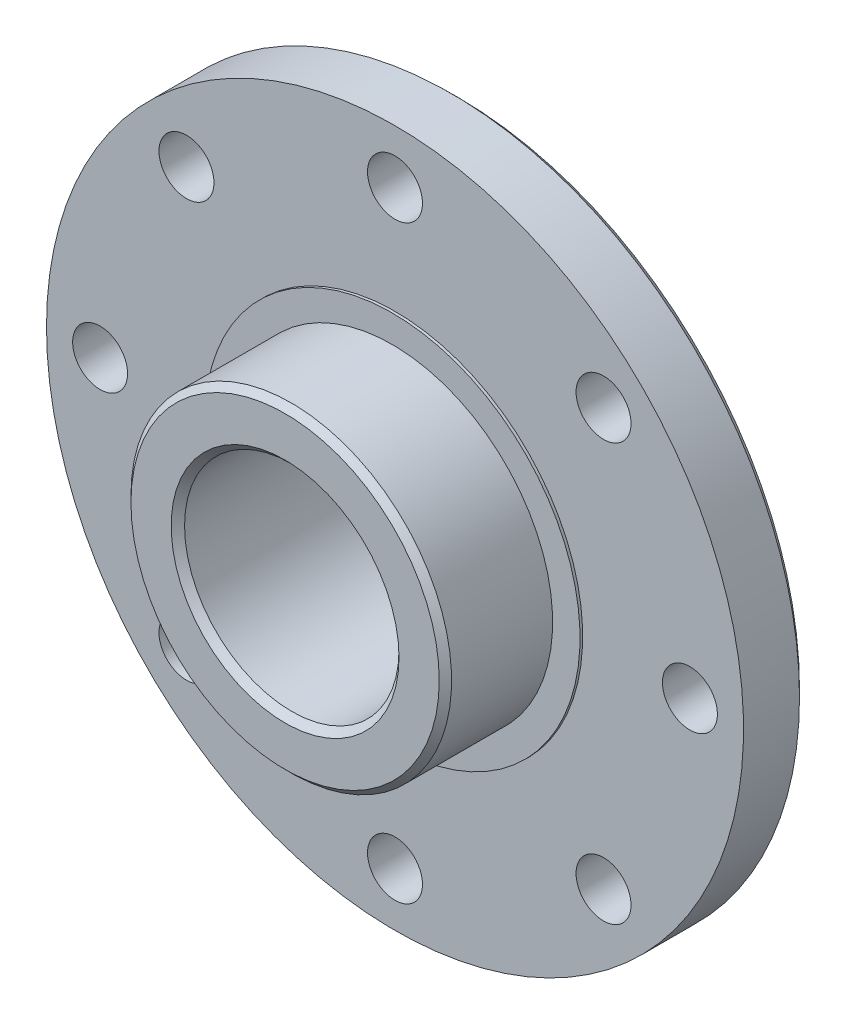
ISO-10303-21;
HEADER;
FILE_DESCRIPTION(('STEP AP214'),'2;1');
FILE_NAME('part.step','',(''),(''),'','','');
FILE_SCHEMA(('AUTOMOTIVE_DESIGN { 1 0 10303 214 1 1 1 1 }'));
ENDSEC;
DATA;
#1=APPLICATION_CONTEXT('core data for automotive mechanical design processes');
#2=APPLICATION_PROTOCOL_DEFINITION('international standard','automotive_design',2000,#1);
#3=PRODUCT_CONTEXT('',#1,'mechanical');
#4=PRODUCT('Part','Part','',(#3));
#5=PRODUCT_RELATED_PRODUCT_CATEGORY('part','',(#4));
#6=PRODUCT_DEFINITION_FORMATION('','',#4);
#7=PRODUCT_DEFINITION_CONTEXT('part definition',#1,'design');
#8=PRODUCT_DEFINITION('design','',#6,#7);
#9=PRODUCT_DEFINITION_SHAPE('','',#8);
#10=(LENGTH_UNIT() NAMED_UNIT(*) SI_UNIT(.MILLI.,.METRE.));
#11=(NAMED_UNIT(*) PLANE_ANGLE_UNIT() SI_UNIT($,.RADIAN.));
#12=(NAMED_UNIT(*) SI_UNIT($,.STERADIAN.) SOLID_ANGLE_UNIT());
#13=UNCERTAINTY_MEASURE_WITH_UNIT(LENGTH_MEASURE(1.E-05),#10,'distance_accuracy_value','');
#14=(GEOMETRIC_REPRESENTATION_CONTEXT(3) GLOBAL_UNCERTAINTY_ASSIGNED_CONTEXT((#13)) GLOBAL_UNIT_ASSIGNED_CONTEXT((#10,
#11,#12)) REPRESENTATION_CONTEXT('',''));
#15=CARTESIAN_POINT('',(0.,0.,0.));
#16=DIRECTION('',(0.,0.,1.));
#17=DIRECTION('',(1.,0.,0.));
#18=AXIS2_PLACEMENT_3D('',#15,#16,#17);
#19=CARTESIAN_POINT('',(-4.00000000000044,12.3693168768528,-22.));
#20=DIRECTION('',(0.,0.,-1.));
#21=DIRECTION('',(-1.,0.,0.));
#22=AXIS2_PLACEMENT_3D('',#19,#20,#21);
#23=PLANE('',#22);
#24=CARTESIAN_POINT('',(0.,0.,-22.));
#25=DIRECTION('',(0.,0.,-1.));
#26=DIRECTION('',(-1.,0.,0.));
#27=AXIS2_PLACEMENT_3D('',#24,#25,#26);
#28=CIRCLE('',#27,13.);
#29=CARTESIAN_POINT('',(-13.,0.,-22.));
#30=VERTEX_POINT('',#29);
#31=EDGE_CURVE('E58',#30,#30,#28,.T.);
#32=ORIENTED_EDGE('',*,*,#31,.F.);
#33=EDGE_LOOP('',(#32));
#34=FACE_BOUND('',#33,.T.);
#35=CARTESIAN_POINT('',(-7.778174593052,7.778174593052,-22.));
#36=DIRECTION('',(0.,0.,-1.));
#37=DIRECTION('',(-1.,0.,0.));
#38=AXIS2_PLACEMENT_3D('',#35,#36,#37);
#39=CIRCLE('',#38,1.025);
#40=CARTESIAN_POINT('',(-8.803174593052,7.778174593052,-22.));
#41=VERTEX_POINT('',#40);
#42=EDGE_CURVE('E98',#41,#41,#39,.T.);
#43=ORIENTED_EDGE('',*,*,#42,.T.);
#44=EDGE_LOOP('',(#43));
#45=FACE_BOUND('',#44,.T.);
#46=CARTESIAN_POINT('',(-11.,0.,-22.));
#47=DIRECTION('',(0.,0.,-1.));
#48=DIRECTION('',(-1.,0.,0.));
#49=AXIS2_PLACEMENT_3D('',#46,#47,#48);
#50=CIRCLE('',#49,1.025);
#51=CARTESIAN_POINT('',(-12.025,0.,-22.));
#52=VERTEX_POINT('',#51);
#53=EDGE_CURVE('E145',#52,#52,#50,.T.);
#54=ORIENTED_EDGE('',*,*,#53,.T.);
#55=EDGE_LOOP('',(#54));
#56=FACE_BOUND('',#55,.T.);
#57=CARTESIAN_POINT('',(-7.778174593052,-7.778174593052,-22.));
#58=DIRECTION('',(0.,0.,-1.));
#59=DIRECTION('',(-1.,0.,0.));
#60=AXIS2_PLACEMENT_3D('',#57,#58,#59);
#61=CIRCLE('',#60,1.025);
#62=CARTESIAN_POINT('',(-8.803174593052,-7.778174593052,-22.));
#63=VERTEX_POINT('',#62);
#64=EDGE_CURVE('E142',#63,#63,#61,.T.);
#65=ORIENTED_EDGE('',*,*,#64,.T.);
#66=EDGE_LOOP('',(#65));
#67=FACE_BOUND('',#66,.T.);
#68=CARTESIAN_POINT('',(0.,-11.,-22.));
#69=DIRECTION('',(0.,0.,-1.));
#70=DIRECTION('',(-1.,0.,0.));
#71=AXIS2_PLACEMENT_3D('',#68,#69,#70);
#72=CIRCLE('',#71,1.025);
#73=CARTESIAN_POINT('',(-1.025,-11.,-22.));
#74=VERTEX_POINT('',#73);
#75=EDGE_CURVE('E139',#74,#74,#72,.T.);
#76=ORIENTED_EDGE('',*,*,#75,.T.);
#77=EDGE_LOOP('',(#76));
#78=FACE_BOUND('',#77,.T.);
#79=CARTESIAN_POINT('',(7.778174593052,-7.778174593052,-22.));
#80=DIRECTION('',(0.,0.,-1.));
#81=DIRECTION('',(-1.,0.,0.));
#82=AXIS2_PLACEMENT_3D('',#79,#80,#81);
#83=CIRCLE('',#82,1.025);
#84=CARTESIAN_POINT('',(6.753174593052,-7.778174593052,-22.));
#85=VERTEX_POINT('',#84);
#86=EDGE_CURVE('E136',#85,#85,#83,.T.);
#87=ORIENTED_EDGE('',*,*,#86,.T.);
#88=EDGE_LOOP('',(#87));
#89=FACE_BOUND('',#88,.T.);
#90=CARTESIAN_POINT('',(11.,0.,-22.));
#91=DIRECTION('',(0.,0.,-1.));
#92=DIRECTION('',(-1.,0.,0.));
#93=AXIS2_PLACEMENT_3D('',#90,#91,#92);
#94=CIRCLE('',#93,1.025);
#95=CARTESIAN_POINT('',(9.975,0.,-22.));
#96=VERTEX_POINT('',#95);
#97=EDGE_CURVE('E133',#96,#96,#94,.T.);
#98=ORIENTED_EDGE('',*,*,#97,.T.);
#99=EDGE_LOOP('',(#98));
#100=FACE_BOUND('',#99,.T.);
#101=CARTESIAN_POINT('',(7.778174593052,7.778174593052,-22.));
#102=DIRECTION('',(0.,0.,-1.));
#103=DIRECTION('',(-1.,0.,0.));
#104=AXIS2_PLACEMENT_3D('',#101,#102,#103);
#105=CIRCLE('',#104,1.025);
#106=CARTESIAN_POINT('',(6.753174593052,7.778174593052,-22.));
#107=VERTEX_POINT('',#106);
#108=EDGE_CURVE('E129',#107,#107,#105,.T.);
#109=ORIENTED_EDGE('',*,*,#108,.T.);
#110=EDGE_LOOP('',(#109));
#111=FACE_BOUND('',#110,.T.);
#112=CARTESIAN_POINT('',(0.,11.,-22.));
#113=DIRECTION('',(0.,0.,-1.));
#114=DIRECTION('',(-1.,0.,0.));
#115=AXIS2_PLACEMENT_3D('',#112,#113,#114);
#116=CIRCLE('',#115,1.025);
#117=CARTESIAN_POINT('',(-1.025,11.,-22.));
#118=VERTEX_POINT('',#117);
#119=EDGE_CURVE('E126',#118,#118,#116,.T.);
#120=ORIENTED_EDGE('',*,*,#119,.T.);
#121=EDGE_LOOP('',(#120));
#122=FACE_BOUND('',#121,.T.);
#123=CARTESIAN_POINT('',(0.,0.,-22.));
#124=DIRECTION('',(0.,0.,-1.));
#125=DIRECTION('',(-1.,0.,0.));
#126=AXIS2_PLACEMENT_3D('',#123,#124,#125);
#127=CIRCLE('',#126,7.);
#128=CARTESIAN_POINT('',(-7.,0.,-22.));
#129=VERTEX_POINT('',#128);
#130=EDGE_CURVE('E94',#129,#129,#127,.F.);
#131=ORIENTED_EDGE('',*,*,#130,.F.);
#132=EDGE_LOOP('',(#131));
#133=FACE_BOUND('',#132,.T.);
#134=ADVANCED_FACE('F37',(#34,#45,#56,#67,#78,#89,#100,#111,#122,#133),#23,.F.);
#135=CARTESIAN_POINT('',(0.,0.,-24.35));
#136=DIRECTION('',(0.,0.,-1.));
#137=DIRECTION('',(-1.,0.,0.));
#138=AXIS2_PLACEMENT_3D('',#135,#136,#137);
#139=PLANE('',#138);
#140=CARTESIAN_POINT('',(0.,0.,-24.35));
#141=DIRECTION('',(0.,0.,-1.));
#142=DIRECTION('',(-1.,0.,0.));
#143=AXIS2_PLACEMENT_3D('',#140,#141,#142);
#144=CIRCLE('',#143,4.31213203435596);
#145=CARTESIAN_POINT('',(-4.31213203435596,0.,-24.35));
#146=VERTEX_POINT('',#145);
#147=EDGE_CURVE('E12',#146,#146,#144,.F.);
#148=ORIENTED_EDGE('',*,*,#147,.T.);
#149=EDGE_LOOP('',(#148));
#150=FACE_BOUND('',#149,.T.);
#151=CARTESIAN_POINT('',(-7.778174593052,7.778174593052,-24.35));
#152=DIRECTION('',(0.,0.,-1.));
#153=DIRECTION('',(-1.,0.,0.));
#154=AXIS2_PLACEMENT_3D('',#151,#152,#153);
#155=CIRCLE('',#154,1.19999999995154);
#156=CARTESIAN_POINT('',(-8.97817459300354,7.778174593052,-24.35));
#157=VERTEX_POINT('',#156);
#158=EDGE_CURVE('E59',#157,#157,#155,.F.);
#159=ORIENTED_EDGE('',*,*,#158,.T.);
#160=EDGE_LOOP('',(#159));
#161=FACE_BOUND('',#160,.T.);
#162=CARTESIAN_POINT('',(-11.,0.,-24.35));
#163=DIRECTION('',(0.,0.,-1.));
#164=DIRECTION('',(-1.,0.,0.));
#165=AXIS2_PLACEMENT_3D('',#162,#163,#164);
#166=CIRCLE('',#165,1.2000000000131);
#167=CARTESIAN_POINT('',(-12.2000000000131,0.,-24.35));
#168=VERTEX_POINT('',#167);
#169=EDGE_CURVE('E62',#168,#168,#166,.F.);
#170=ORIENTED_EDGE('',*,*,#169,.T.);
#171=EDGE_LOOP('',(#170));
#172=FACE_BOUND('',#171,.T.);
#173=CARTESIAN_POINT('',(-7.778174593052,-7.778174593052,-24.35));
#174=DIRECTION('',(0.,0.,-1.));
#175=DIRECTION('',(-1.,0.,0.));
#176=AXIS2_PLACEMENT_3D('',#173,#174,#175);
#177=CIRCLE('',#176,1.19999999995154);
#178=CARTESIAN_POINT('',(-8.97817459300354,-7.778174593052,-24.35));
#179=VERTEX_POINT('',#178);
#180=EDGE_CURVE('E65',#179,#179,#177,.F.);
#181=ORIENTED_EDGE('',*,*,#180,.T.);
#182=EDGE_LOOP('',(#181));
#183=FACE_BOUND('',#182,.T.);
#184=CARTESIAN_POINT('',(0.,-11.,-24.35));
#185=DIRECTION('',(0.,0.,-1.));
#186=DIRECTION('',(-1.,0.,0.));
#187=AXIS2_PLACEMENT_3D('',#184,#185,#186);
#188=CIRCLE('',#187,1.2000000000131);
#189=CARTESIAN_POINT('',(-1.2000000000131,-11.,-24.35));
#190=VERTEX_POINT('',#189);
#191=EDGE_CURVE('E68',#190,#190,#188,.F.);
#192=ORIENTED_EDGE('',*,*,#191,.T.);
#193=EDGE_LOOP('',(#192));
#194=FACE_BOUND('',#193,.T.);
#195=CARTESIAN_POINT('',(7.778174593052,-7.778174593052,-24.35));
#196=DIRECTION('',(0.,0.,-1.));
#197=DIRECTION('',(-1.,0.,0.));
#198=AXIS2_PLACEMENT_3D('',#195,#196,#197);
#199=CIRCLE('',#198,1.19999999995154);
#200=CARTESIAN_POINT('',(6.57817459310046,-7.778174593052,-24.35));
#201=VERTEX_POINT('',#200);
#202=EDGE_CURVE('E71',#201,#201,#199,.F.);
#203=ORIENTED_EDGE('',*,*,#202,.T.);
#204=EDGE_LOOP('',(#203));
#205=FACE_BOUND('',#204,.T.);
#206=CARTESIAN_POINT('',(11.,0.,-24.35));
#207=DIRECTION('',(0.,0.,-1.));
#208=DIRECTION('',(-1.,0.,0.));
#209=AXIS2_PLACEMENT_3D('',#206,#207,#208);
#210=CIRCLE('',#209,1.2000000000131);
#211=CARTESIAN_POINT('',(9.7999999999869,0.,-24.35));
#212=VERTEX_POINT('',#211);
#213=EDGE_CURVE('E74',#212,#212,#210,.F.);
#214=ORIENTED_EDGE('',*,*,#213,.T.);
#215=EDGE_LOOP('',(#214));
#216=FACE_BOUND('',#215,.T.);
#217=CARTESIAN_POINT('',(7.778174593052,7.778174593052,-24.35));
#218=DIRECTION('',(0.,0.,-1.));
#219=DIRECTION('',(-1.,0.,0.));
#220=AXIS2_PLACEMENT_3D('',#217,#218,#219);
#221=CIRCLE('',#220,1.19999999995154);
#222=CARTESIAN_POINT('',(6.57817459310046,7.778174593052,-24.35));
#223=VERTEX_POINT('',#222);
#224=EDGE_CURVE('E77',#223,#223,#221,.F.);
#225=ORIENTED_EDGE('',*,*,#224,.T.);
#226=EDGE_LOOP('',(#225));
#227=FACE_BOUND('',#226,.T.);
#228=CARTESIAN_POINT('',(0.,11.,-24.35));
#229=DIRECTION('',(0.,0.,-1.));
#230=DIRECTION('',(-1.,0.,0.));
#231=AXIS2_PLACEMENT_3D('',#228,#229,#230);
#232=CIRCLE('',#231,1.2000000000131);
#233=CARTESIAN_POINT('',(-1.2000000000131,11.,-24.35));
#234=VERTEX_POINT('',#233);
#235=EDGE_CURVE('E79',#234,#234,#232,.F.);
#236=ORIENTED_EDGE('',*,*,#235,.T.);
#237=EDGE_LOOP('',(#236));
#238=FACE_BOUND('',#237,.T.);
#239=CARTESIAN_POINT('',(0.,-1.14491749414469E-13,-24.35));
#240=DIRECTION('',(0.,0.,-1.));
#241=DIRECTION('',(-1.,0.,0.));
#242=AXIS2_PLACEMENT_3D('',#239,#240,#241);
#243=CIRCLE('',#242,12.7378679656441);
#244=CARTESIAN_POINT('',(-12.7378679656441,-1.14491749414469E-13,-24.35));
#245=VERTEX_POINT('',#244);
#246=EDGE_CURVE('E53',#245,#245,#243,.F.);
#247=ORIENTED_EDGE('',*,*,#246,.F.);
#248=EDGE_LOOP('',(#247));
#249=FACE_BOUND('',#248,.T.);
#250=ADVANCED_FACE('F39',(#150,#161,#172,#183,#194,#205,#216,#227,#238,#249),#139,.T.);
#251=CARTESIAN_POINT('',(0.,-1.14491749414469E-13,-24.193933982822));
#252=DIRECTION('',(0.,0.,1.));
#253=DIRECTION('',(1.,0.,0.));
#254=AXIS2_PLACEMENT_3D('',#251,#252,#253);
#255=CONICAL_SURFACE('',#254,12.893933982822,0.785398163397297);
#256=ORIENTED_EDGE('',*,*,#246,.T.);
#257=EDGE_LOOP('',(#256));
#258=FACE_BOUND('',#257,.T.);
#259=CARTESIAN_POINT('',(0.,-1.14491749414469E-13,-24.087867965644));
#260=DIRECTION('',(0.,0.,1.));
#261=DIRECTION('',(1.,0.,0.));
#262=AXIS2_PLACEMENT_3D('',#259,#260,#261);
#263=CIRCLE('',#262,13.);
#264=CARTESIAN_POINT('',(13.,-1.14491749414469E-13,-24.087867965644));
#265=VERTEX_POINT('',#264);
#266=EDGE_CURVE('E55',#265,#265,#263,.T.);
#267=ORIENTED_EDGE('',*,*,#266,.F.);
#268=EDGE_LOOP('',(#267));
#269=FACE_BOUND('',#268,.T.);
#270=ADVANCED_FACE('F178',(#258,#269),#255,.T.);
#271=CARTESIAN_POINT('',(0.,0.,-21.875));
#272=DIRECTION('',(0.,0.,-1.));
#273=DIRECTION('',(-1.,0.,0.));
#274=AXIS2_PLACEMENT_3D('',#271,#272,#273);
#275=CYLINDRICAL_SURFACE('',#274,13.);
#276=ORIENTED_EDGE('',*,*,#31,.T.);
#277=EDGE_LOOP('',(#276));
#278=FACE_BOUND('',#277,.T.);
#279=ORIENTED_EDGE('',*,*,#266,.T.);
#280=EDGE_LOOP('',(#279));
#281=FACE_BOUND('',#280,.T.);
#282=ADVANCED_FACE('F193',(#278,#281),#275,.T.);
#283=CARTESIAN_POINT('',(-7.778174593052,7.778174593052,-24.4999999999891));
#284=DIRECTION('',(0.,0.,-1.));
#285=DIRECTION('',(-1.,0.,0.));
#286=AXIS2_PLACEMENT_3D('',#283,#284,#285);
#287=CONICAL_SURFACE('',#286,1.34999999994634,0.785398163416473);
#288=CARTESIAN_POINT('',(-7.778174593052,7.778174593052,-24.1750000000138));
#289=DIRECTION('',(0.,0.,-1.));
#290=DIRECTION('',(0.707106781182139,0.707106781190956,0.));
#291=AXIS2_PLACEMENT_3D('',#288,#289,#290);
#292=CIRCLE('',#291,1.02499999999201);
#293=CARTESIAN_POINT('',(-7.05339014234596,8.50295904376708,-24.1750000000138));
#294=VERTEX_POINT('',#293);
#295=EDGE_CURVE('E81',#294,#294,#292,.T.);
#296=ORIENTED_EDGE('',*,*,#295,.F.);
#297=EDGE_LOOP('',(#296));
#298=FACE_BOUND('',#297,.T.);
#299=ORIENTED_EDGE('',*,*,#158,.F.);
#300=EDGE_LOOP('',(#299));
#301=FACE_BOUND('',#300,.T.);
#302=ADVANCED_FACE('F198',(#298,#301),#287,.F.);
#303=CARTESIAN_POINT('',(-7.778174593052,7.778174593052,-21.22832375877));
#304=DIRECTION('',(0.,0.,-1.));
#305=DIRECTION('',(-1.,0.,0.));
#306=AXIS2_PLACEMENT_3D('',#303,#304,#305);
#307=CYLINDRICAL_SURFACE('',#306,1.025);
#308=ORIENTED_EDGE('',*,*,#295,.T.);
#309=EDGE_LOOP('',(#308));
#310=FACE_BOUND('',#309,.T.);
#311=ORIENTED_EDGE('',*,*,#42,.F.);
#312=EDGE_LOOP('',(#311));
#313=FACE_BOUND('',#312,.T.);
#314=ADVANCED_FACE('F204',(#310,#313),#307,.F.);
#315=CARTESIAN_POINT('',(-11.,0.,-24.4999999999891));
#316=DIRECTION('',(0.,0.,-1.));
#317=DIRECTION('',(-1.,0.,0.));
#318=AXIS2_PLACEMENT_3D('',#315,#316,#317);
#319=CONICAL_SURFACE('',#318,1.35000000000218,0.785398163397448);
#320=CARTESIAN_POINT('',(-11.,0.,-24.1750000000138));
#321=DIRECTION('',(0.,0.,-1.));
#322=DIRECTION('',(0.,1.,0.));
#323=AXIS2_PLACEMENT_3D('',#320,#321,#322);
#324=CIRCLE('',#323,1.02500000002692);
#325=CARTESIAN_POINT('',(-11.,1.02500000002692,-24.1750000000138));
#326=VERTEX_POINT('',#325);
#327=EDGE_CURVE('E85',#326,#326,#324,.T.);
#328=ORIENTED_EDGE('',*,*,#327,.F.);
#329=EDGE_LOOP('',(#328));
#330=FACE_BOUND('',#329,.T.);
#331=ORIENTED_EDGE('',*,*,#169,.F.);
#332=EDGE_LOOP('',(#331));
#333=FACE_BOUND('',#332,.T.);
#334=ADVANCED_FACE('F257',(#330,#333),#319,.F.);
#335=CARTESIAN_POINT('',(-11.,0.,-21.22832375877));
#336=DIRECTION('',(0.,0.,-1.));
#337=DIRECTION('',(-1.,0.,0.));
#338=AXIS2_PLACEMENT_3D('',#335,#336,#337);
#339=CYLINDRICAL_SURFACE('',#338,1.025);
#340=ORIENTED_EDGE('',*,*,#327,.T.);
#341=EDGE_LOOP('',(#340));
#342=FACE_BOUND('',#341,.T.);
#343=ORIENTED_EDGE('',*,*,#53,.F.);
#344=EDGE_LOOP('',(#343));
#345=FACE_BOUND('',#344,.T.);
#346=ADVANCED_FACE('F172',(#342,#345),#339,.F.);
#347=CARTESIAN_POINT('',(-7.778174593052,-7.778174593052,-24.4999999999891));
#348=DIRECTION('',(0.,0.,-1.));
#349=DIRECTION('',(-1.,0.,0.));
#350=AXIS2_PLACEMENT_3D('',#347,#348,#349);
#351=CONICAL_SURFACE('',#350,1.34999999994634,0.785398163416473);
#352=CARTESIAN_POINT('',(-7.778174593052,-7.778174593052,-24.1750000000138));
#353=DIRECTION('',(0.,0.,-1.));
#354=DIRECTION('',(-0.707106781190956,0.707106781182139,0.));
#355=AXIS2_PLACEMENT_3D('',#352,#353,#354);
#356=CIRCLE('',#355,1.02499999999201);
#357=CARTESIAN_POINT('',(-8.50295904376708,-7.05339014234596,-24.1750000000138));
#358=VERTEX_POINT('',#357);
#359=EDGE_CURVE('E90',#358,#358,#356,.T.);
#360=ORIENTED_EDGE('',*,*,#359,.F.);
#361=EDGE_LOOP('',(#360));
#362=FACE_BOUND('',#361,.T.);
#363=ORIENTED_EDGE('',*,*,#180,.F.);
#364=EDGE_LOOP('',(#363));
#365=FACE_BOUND('',#364,.T.);
#366=ADVANCED_FACE('F169',(#362,#365),#351,.F.);
#367=CARTESIAN_POINT('',(-7.778174593052,-7.778174593052,-21.22832375877));
#368=DIRECTION('',(0.,0.,-1.));
#369=DIRECTION('',(-1.,0.,0.));
#370=AXIS2_PLACEMENT_3D('',#367,#368,#369);
#371=CYLINDRICAL_SURFACE('',#370,1.025);
#372=ORIENTED_EDGE('',*,*,#359,.T.);
#373=EDGE_LOOP('',(#372));
#374=FACE_BOUND('',#373,.T.);
#375=ORIENTED_EDGE('',*,*,#64,.F.);
#376=EDGE_LOOP('',(#375));
#377=FACE_BOUND('',#376,.T.);
#378=ADVANCED_FACE('F166',(#374,#377),#371,.F.);
#379=CARTESIAN_POINT('',(0.,-11.,-24.4999999999891));
#380=DIRECTION('',(0.,0.,-1.));
#381=DIRECTION('',(-1.,0.,0.));
#382=AXIS2_PLACEMENT_3D('',#379,#380,#381);
#383=CONICAL_SURFACE('',#382,1.35000000000218,0.785398163397448);
#384=CARTESIAN_POINT('',(0.,-11.,-24.1750000000138));
#385=DIRECTION('',(0.,0.,-1.));
#386=DIRECTION('',(-1.,0.,0.));
#387=AXIS2_PLACEMENT_3D('',#384,#385,#386);
#388=CIRCLE('',#387,1.02500000002692);
#389=CARTESIAN_POINT('',(-1.02500000002692,-11.,-24.1750000000138));
#390=VERTEX_POINT('',#389);
#391=EDGE_CURVE('E161',#390,#390,#388,.T.);
#392=ORIENTED_EDGE('',*,*,#391,.F.);
#393=EDGE_LOOP('',(#392));
#394=FACE_BOUND('',#393,.T.);
#395=ORIENTED_EDGE('',*,*,#191,.F.);
#396=EDGE_LOOP('',(#395));
#397=FACE_BOUND('',#396,.T.);
#398=ADVANCED_FACE('F251',(#394,#397),#383,.F.);
#399=CARTESIAN_POINT('',(0.,-11.,-21.22832375877));
#400=DIRECTION('',(0.,0.,-1.));
#401=DIRECTION('',(-1.,0.,0.));
#402=AXIS2_PLACEMENT_3D('',#399,#400,#401);
#403=CYLINDRICAL_SURFACE('',#402,1.025);
#404=ORIENTED_EDGE('',*,*,#391,.T.);
#405=EDGE_LOOP('',(#404));
#406=FACE_BOUND('',#405,.T.);
#407=ORIENTED_EDGE('',*,*,#75,.F.);
#408=EDGE_LOOP('',(#407));
#409=FACE_BOUND('',#408,.T.);
#410=ADVANCED_FACE('F248',(#406,#409),#403,.F.);
#411=CARTESIAN_POINT('',(7.778174593052,-7.778174593052,-24.4999999999891));
#412=DIRECTION('',(0.,0.,-1.));
#413=DIRECTION('',(-1.,0.,0.));
#414=AXIS2_PLACEMENT_3D('',#411,#412,#413);
#415=CONICAL_SURFACE('',#414,1.34999999994634,0.785398163416473);
#416=CARTESIAN_POINT('',(7.778174593052,-7.778174593052,-24.1750000000138));
#417=DIRECTION('',(0.,0.,-1.));
#418=DIRECTION('',(-0.707106781182139,-0.707106781190956,0.));
#419=AXIS2_PLACEMENT_3D('',#416,#417,#418);
#420=CIRCLE('',#419,1.02499999999201);
#421=CARTESIAN_POINT('',(7.05339014234596,-8.50295904376708,-24.1750000000138));
#422=VERTEX_POINT('',#421);
#423=EDGE_CURVE('E158',#422,#422,#420,.T.);
#424=ORIENTED_EDGE('',*,*,#423,.F.);
#425=EDGE_LOOP('',(#424));
#426=FACE_BOUND('',#425,.T.);
#427=ORIENTED_EDGE('',*,*,#202,.F.);
#428=EDGE_LOOP('',(#427));
#429=FACE_BOUND('',#428,.T.);
#430=ADVANCED_FACE('F246',(#426,#429),#415,.F.);
#431=CARTESIAN_POINT('',(7.778174593052,-7.778174593052,-21.22832375877));
#432=DIRECTION('',(0.,0.,-1.));
#433=DIRECTION('',(-1.,0.,0.));
#434=AXIS2_PLACEMENT_3D('',#431,#432,#433);
#435=CYLINDRICAL_SURFACE('',#434,1.025);
#436=ORIENTED_EDGE('',*,*,#423,.T.);
#437=EDGE_LOOP('',(#436));
#438=FACE_BOUND('',#437,.T.);
#439=ORIENTED_EDGE('',*,*,#86,.F.);
#440=EDGE_LOOP('',(#439));
#441=FACE_BOUND('',#440,.T.);
#442=ADVANCED_FACE('F243',(#438,#441),#435,.F.);
#443=CARTESIAN_POINT('',(11.,0.,-24.4999999999891));
#444=DIRECTION('',(0.,0.,-1.));
#445=DIRECTION('',(-1.,0.,0.));
#446=AXIS2_PLACEMENT_3D('',#443,#444,#445);
#447=CONICAL_SURFACE('',#446,1.35000000000218,0.785398163397448);
#448=CARTESIAN_POINT('',(11.,0.,-24.1750000000138));
#449=DIRECTION('',(0.,0.,-1.));
#450=DIRECTION('',(0.,-1.,0.));
#451=AXIS2_PLACEMENT_3D('',#448,#449,#450);
#452=CIRCLE('',#451,1.02500000002692);
#453=CARTESIAN_POINT('',(11.,-1.02500000002692,-24.1750000000138));
#454=VERTEX_POINT('',#453);
#455=EDGE_CURVE('E155',#454,#454,#452,.T.);
#456=ORIENTED_EDGE('',*,*,#455,.F.);
#457=EDGE_LOOP('',(#456));
#458=FACE_BOUND('',#457,.T.);
#459=ORIENTED_EDGE('',*,*,#213,.F.);
#460=EDGE_LOOP('',(#459));
#461=FACE_BOUND('',#460,.T.);
#462=ADVANCED_FACE('F241',(#458,#461),#447,.F.);
#463=CARTESIAN_POINT('',(11.,0.,-21.22832375877));
#464=DIRECTION('',(0.,0.,-1.));
#465=DIRECTION('',(-1.,0.,0.));
#466=AXIS2_PLACEMENT_3D('',#463,#464,#465);
#467=CYLINDRICAL_SURFACE('',#466,1.025);
#468=ORIENTED_EDGE('',*,*,#455,.T.);
#469=EDGE_LOOP('',(#468));
#470=FACE_BOUND('',#469,.T.);
#471=ORIENTED_EDGE('',*,*,#97,.F.);
#472=EDGE_LOOP('',(#471));
#473=FACE_BOUND('',#472,.T.);
#474=ADVANCED_FACE('F238',(#470,#473),#467,.F.);
#475=CARTESIAN_POINT('',(7.778174593052,7.778174593052,-24.4999999999891));
#476=DIRECTION('',(0.,0.,-1.));
#477=DIRECTION('',(-1.,0.,0.));
#478=AXIS2_PLACEMENT_3D('',#475,#476,#477);
#479=CONICAL_SURFACE('',#478,1.34999999994634,0.785398163416473);
#480=CARTESIAN_POINT('',(7.778174593052,7.778174593052,-24.1750000000138));
#481=DIRECTION('',(0.,0.,-1.));
#482=DIRECTION('',(0.707106781190956,-0.707106781182139,0.));
#483=AXIS2_PLACEMENT_3D('',#480,#481,#482);
#484=CIRCLE('',#483,1.02499999999201);
#485=CARTESIAN_POINT('',(8.50295904376708,7.05339014234596,-24.1750000000138));
#486=VERTEX_POINT('',#485);
#487=EDGE_CURVE('E152',#486,#486,#484,.T.);
#488=ORIENTED_EDGE('',*,*,#487,.F.);
#489=EDGE_LOOP('',(#488));
#490=FACE_BOUND('',#489,.T.);
#491=ORIENTED_EDGE('',*,*,#224,.F.);
#492=EDGE_LOOP('',(#491));
#493=FACE_BOUND('',#492,.T.);
#494=ADVANCED_FACE('F236',(#490,#493),#479,.F.);
#495=CARTESIAN_POINT('',(7.778174593052,7.778174593052,-21.22832375877));
#496=DIRECTION('',(0.,0.,-1.));
#497=DIRECTION('',(-1.,0.,0.));
#498=AXIS2_PLACEMENT_3D('',#495,#496,#497);
#499=CYLINDRICAL_SURFACE('',#498,1.025);
#500=ORIENTED_EDGE('',*,*,#487,.T.);
#501=EDGE_LOOP('',(#500));
#502=FACE_BOUND('',#501,.T.);
#503=ORIENTED_EDGE('',*,*,#108,.F.);
#504=EDGE_LOOP('',(#503));
#505=FACE_BOUND('',#504,.T.);
#506=ADVANCED_FACE('F229',(#502,#505),#499,.F.);
#507=CARTESIAN_POINT('',(0.,11.,-24.4999999999891));
#508=DIRECTION('',(0.,0.,-1.));
#509=DIRECTION('',(-1.,0.,0.));
#510=AXIS2_PLACEMENT_3D('',#507,#508,#509);
#511=CONICAL_SURFACE('',#510,1.35000000000218,0.785398163397448);
#512=CARTESIAN_POINT('',(0.,11.,-24.1750000000138));
#513=DIRECTION('',(0.,0.,-1.));
#514=DIRECTION('',(1.,0.,0.));
#515=AXIS2_PLACEMENT_3D('',#512,#513,#514);
#516=CIRCLE('',#515,1.02500000002692);
#517=CARTESIAN_POINT('',(1.02500000002692,11.,-24.1750000000138));
#518=VERTEX_POINT('',#517);
#519=EDGE_CURVE('E130',#518,#518,#516,.T.);
#520=ORIENTED_EDGE('',*,*,#519,.F.);
#521=EDGE_LOOP('',(#520));
#522=FACE_BOUND('',#521,.T.);
#523=ORIENTED_EDGE('',*,*,#235,.F.);
#524=EDGE_LOOP('',(#523));
#525=FACE_BOUND('',#524,.T.);
#526=ADVANCED_FACE('F218',(#522,#525),#511,.F.);
#527=CARTESIAN_POINT('',(0.,11.,-21.22832375877));
#528=DIRECTION('',(0.,0.,-1.));
#529=DIRECTION('',(-1.,0.,0.));
#530=AXIS2_PLACEMENT_3D('',#527,#528,#529);
#531=CYLINDRICAL_SURFACE('',#530,1.025);
#532=ORIENTED_EDGE('',*,*,#519,.T.);
#533=EDGE_LOOP('',(#532));
#534=FACE_BOUND('',#533,.T.);
#535=ORIENTED_EDGE('',*,*,#119,.F.);
#536=EDGE_LOOP('',(#535));
#537=FACE_BOUND('',#536,.T.);
#538=ADVANCED_FACE('F210',(#534,#537),#531,.F.);
#539=CARTESIAN_POINT('',(0.,0.,3.73868683519033));
#540=DIRECTION('',(0.,0.,-1.));
#541=DIRECTION('',(-1.,0.,0.));
#542=AXIS2_PLACEMENT_3D('',#539,#540,#541);
#543=CYLINDRICAL_SURFACE('',#542,4.);
#544=CARTESIAN_POINT('',(0.,0.,-18.15));
#545=DIRECTION('',(0.,0.,1.));
#546=DIRECTION('',(1.,0.,0.));
#547=AXIS2_PLACEMENT_3D('',#544,#545,#546);
#548=CIRCLE('',#547,4.);
#549=CARTESIAN_POINT('',(4.,0.,-18.15));
#550=VERTEX_POINT('',#549);
#551=EDGE_CURVE('E45',#550,#550,#548,.T.);
#552=ORIENTED_EDGE('',*,*,#551,.T.);
#553=EDGE_LOOP('',(#552));
#554=FACE_BOUND('',#553,.T.);
#555=CARTESIAN_POINT('',(0.,0.,-24.037867965644));
#556=DIRECTION('',(0.,0.,-1.));
#557=DIRECTION('',(-1.,0.,0.));
#558=AXIS2_PLACEMENT_3D('',#555,#556,#557);
#559=CIRCLE('',#558,4.);
#560=CARTESIAN_POINT('',(-4.,0.,-24.037867965644));
#561=VERTEX_POINT('',#560);
#562=EDGE_CURVE('E41',#561,#561,#559,.T.);
#563=ORIENTED_EDGE('',*,*,#562,.T.);
#564=EDGE_LOOP('',(#563));
#565=FACE_BOUND('',#564,.T.);
#566=ADVANCED_FACE('F179',(#554,#565),#543,.F.);
#567=CARTESIAN_POINT('',(0.,0.,0.498989873223332));
#568=DIRECTION('',(0.,0.,-1.));
#569=DIRECTION('',(-1.,0.,0.));
#570=AXIS2_PLACEMENT_3D('',#567,#568,#569);
#571=CYLINDRICAL_SURFACE('',#570,7.);
#572=CARTESIAN_POINT('',(0.,0.,-21.9));
#573=DIRECTION('',(0.,0.,-1.));
#574=DIRECTION('',(-1.,0.,0.));
#575=AXIS2_PLACEMENT_3D('',#572,#573,#574);
#576=CIRCLE('',#575,7.);
#577=CARTESIAN_POINT('',(-7.,0.,-21.9));
#578=VERTEX_POINT('',#577);
#579=EDGE_CURVE('E120',#578,#578,#576,.T.);
#580=ORIENTED_EDGE('',*,*,#579,.T.);
#581=EDGE_LOOP('',(#580));
#582=FACE_BOUND('',#581,.T.);
#583=ORIENTED_EDGE('',*,*,#130,.T.);
#584=EDGE_LOOP('',(#583));
#585=FACE_BOUND('',#584,.T.);
#586=ADVANCED_FACE('F116',(#582,#585),#571,.T.);
#587=CARTESIAN_POINT('',(0.,0.,-21.9));
#588=DIRECTION('',(0.,0.,-1.));
#589=DIRECTION('',(-1.,0.,0.));
#590=AXIS2_PLACEMENT_3D('',#587,#588,#589);
#591=PLANE('',#590);
#592=CARTESIAN_POINT('',(0.,0.,-21.9));
#593=DIRECTION('',(0.,0.,-1.));
#594=DIRECTION('',(-1.,0.,0.));
#595=AXIS2_PLACEMENT_3D('',#592,#593,#594);
#596=CIRCLE('',#595,5.98);
#597=CARTESIAN_POINT('',(-5.98,0.,-21.9));
#598=VERTEX_POINT('',#597);
#599=EDGE_CURVE('E97',#598,#598,#596,.F.);
#600=ORIENTED_EDGE('',*,*,#599,.F.);
#601=EDGE_LOOP('',(#600));
#602=FACE_BOUND('',#601,.T.);
#603=ORIENTED_EDGE('',*,*,#579,.F.);
#604=EDGE_LOOP('',(#603));
#605=FACE_BOUND('',#604,.T.);
#606=ADVANCED_FACE('F112',(#602,#605),#591,.F.);
#607=CARTESIAN_POINT('',(0.,0.,-17.9));
#608=DIRECTION('',(0.,0.,1.));
#609=DIRECTION('',(1.,0.,0.));
#610=AXIS2_PLACEMENT_3D('',#607,#608,#609);
#611=PLANE('',#610);
#612=CARTESIAN_POINT('',(0.,0.,-17.9));
#613=DIRECTION('',(0.,0.,1.));
#614=DIRECTION('',(1.,0.,0.));
#615=AXIS2_PLACEMENT_3D('',#612,#613,#614);
#616=CIRCLE('',#615,5.75000000000001);
#617=CARTESIAN_POINT('',(5.75000000000001,0.,-17.9));
#618=VERTEX_POINT('',#617);
#619=EDGE_CURVE('E102',#618,#618,#616,.T.);
#620=ORIENTED_EDGE('',*,*,#619,.T.);
#621=EDGE_LOOP('',(#620));
#622=FACE_BOUND('',#621,.T.);
#623=CARTESIAN_POINT('',(0.,0.,-17.9));
#624=DIRECTION('',(0.,0.,1.));
#625=DIRECTION('',(1.,0.,0.));
#626=AXIS2_PLACEMENT_3D('',#623,#624,#625);
#627=CIRCLE('',#626,4.25);
#628=CARTESIAN_POINT('',(4.25,0.,-17.9));
#629=VERTEX_POINT('',#628);
#630=EDGE_CURVE('E99',#629,#629,#627,.F.);
#631=ORIENTED_EDGE('',*,*,#630,.T.);
#632=EDGE_LOOP('',(#631));
#633=FACE_BOUND('',#632,.T.);
#634=ADVANCED_FACE('F115',(#622,#633),#611,.T.);
#635=CARTESIAN_POINT('',(0.,0.,-17.9));
#636=DIRECTION('',(0.,0.,-1.));
#637=DIRECTION('',(-1.,0.,0.));
#638=AXIS2_PLACEMENT_3D('',#635,#636,#637);
#639=CYLINDRICAL_SURFACE('',#638,5.98);
#640=CARTESIAN_POINT('',(0.,0.,-18.13));
#641=DIRECTION('',(0.,0.,-1.));
#642=DIRECTION('',(-1.,0.,0.));
#643=AXIS2_PLACEMENT_3D('',#640,#641,#642);
#644=CIRCLE('',#643,5.98);
#645=CARTESIAN_POINT('',(-5.98,0.,-18.13));
#646=VERTEX_POINT('',#645);
#647=EDGE_CURVE('E104',#646,#646,#644,.T.);
#648=ORIENTED_EDGE('',*,*,#647,.T.);
#649=EDGE_LOOP('',(#648));
#650=FACE_BOUND('',#649,.T.);
#651=ORIENTED_EDGE('',*,*,#599,.T.);
#652=EDGE_LOOP('',(#651));
#653=FACE_BOUND('',#652,.T.);
#654=ADVANCED_FACE('F110',(#650,#653),#639,.T.);
#655=CARTESIAN_POINT('',(0.,0.,-17.9));
#656=DIRECTION('',(0.,0.,-1.));
#657=DIRECTION('',(-1.,0.,0.));
#658=AXIS2_PLACEMENT_3D('',#655,#656,#657);
#659=CONICAL_SURFACE('',#658,5.75000000000001,0.785398163397447);
#660=ORIENTED_EDGE('',*,*,#647,.F.);
#661=EDGE_LOOP('',(#660));
#662=FACE_BOUND('',#661,.T.);
#663=ORIENTED_EDGE('',*,*,#619,.F.);
#664=EDGE_LOOP('',(#663));
#665=FACE_BOUND('',#664,.T.);
#666=ADVANCED_FACE('F311',(#662,#665),#659,.T.);
#667=CARTESIAN_POINT('',(0.,0.,-18.15));
#668=DIRECTION('',(0.,0.,1.));
#669=DIRECTION('',(1.,0.,0.));
#670=AXIS2_PLACEMENT_3D('',#667,#668,#669);
#671=CONICAL_SURFACE('',#670,4.,0.785398163397448);
#672=ORIENTED_EDGE('',*,*,#630,.F.);
#673=EDGE_LOOP('',(#672));
#674=FACE_BOUND('',#673,.T.);
#675=ORIENTED_EDGE('',*,*,#551,.F.);
#676=EDGE_LOOP('',(#675));
#677=FACE_BOUND('',#676,.T.);
#678=ADVANCED_FACE('F318',(#674,#677),#671,.F.);
#679=CARTESIAN_POINT('',(0.,0.,-24.143933982822));
#680=DIRECTION('',(0.,0.,-1.));
#681=DIRECTION('',(-1.,0.,0.));
#682=AXIS2_PLACEMENT_3D('',#679,#680,#681);
#683=CONICAL_SURFACE('',#682,4.10606601717798,0.785398163397441);
#684=ORIENTED_EDGE('',*,*,#147,.F.);
#685=EDGE_LOOP('',(#684));
#686=FACE_BOUND('',#685,.T.);
#687=ORIENTED_EDGE('',*,*,#562,.F.);
#688=EDGE_LOOP('',(#687));
#689=FACE_BOUND('',#688,.T.);
#690=ADVANCED_FACE('F321',(#686,#689),#683,.F.);
#691=CLOSED_SHELL('',(#134,#250,#270,#282,#302,#314,#334,#346,#366,#378,#398,#410,#430,#442,
#462,#474,#494,#506,#526,#538,#566,#586,#606,#634,#654,#666,#678,#690));
#692=MANIFOLD_SOLID_BREP('B2',#691);
#693=ADVANCED_BREP_SHAPE_REPRESENTATION('',(#18,#692),#14);
#694=SHAPE_DEFINITION_REPRESENTATION(#9,#693);
ENDSEC;
END-ISO-10303-21;
